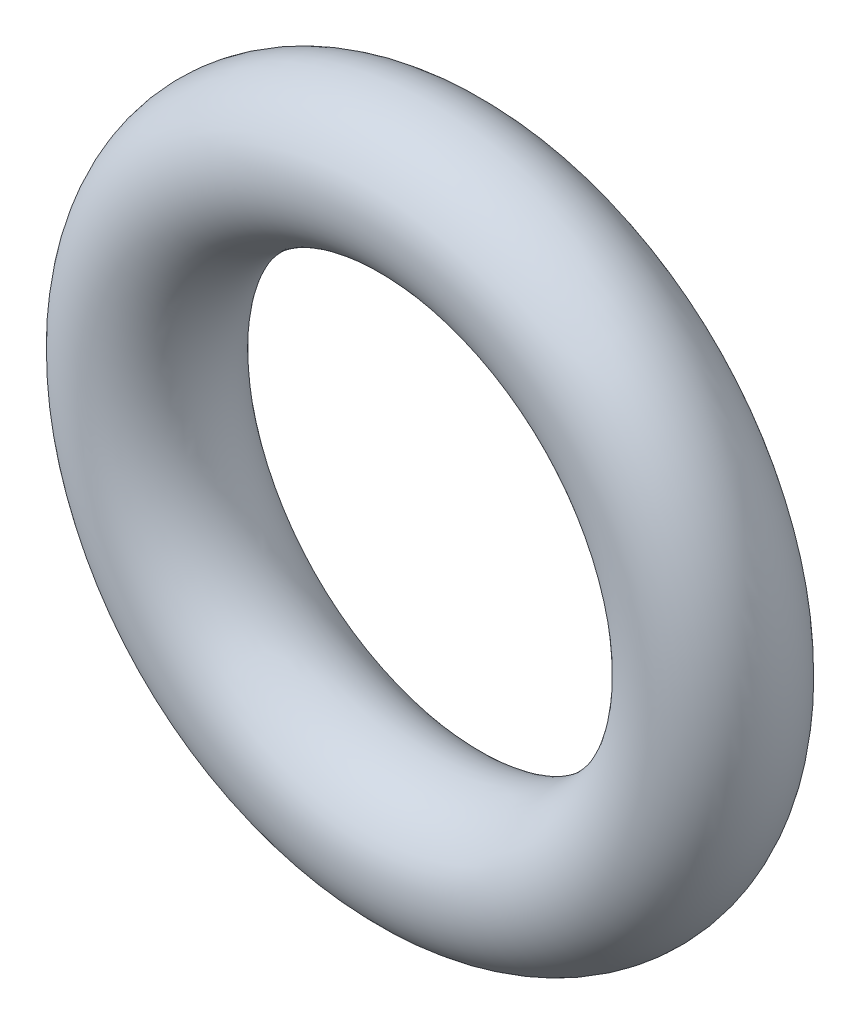
ISO-10303-21;
HEADER;
FILE_DESCRIPTION(('STEP AP214'),'2;1');
FILE_NAME('part.step','',(''),(''),'','','');
FILE_SCHEMA(('AUTOMOTIVE_DESIGN { 1 0 10303 214 1 1 1 1 }'));
ENDSEC;
DATA;
#1=APPLICATION_CONTEXT('core data for automotive mechanical design processes');
#2=APPLICATION_PROTOCOL_DEFINITION('international standard','automotive_design',2000,#1);
#3=PRODUCT_CONTEXT('',#1,'mechanical');
#4=PRODUCT('Part','Part','',(#3));
#5=PRODUCT_RELATED_PRODUCT_CATEGORY('part','',(#4));
#6=PRODUCT_DEFINITION_FORMATION('','',#4);
#7=PRODUCT_DEFINITION_CONTEXT('part definition',#1,'design');
#8=PRODUCT_DEFINITION('design','',#6,#7);
#9=PRODUCT_DEFINITION_SHAPE('','',#8);
#10=(LENGTH_UNIT() NAMED_UNIT(*) SI_UNIT(.MILLI.,.METRE.));
#11=(NAMED_UNIT(*) PLANE_ANGLE_UNIT() SI_UNIT($,.RADIAN.));
#12=(NAMED_UNIT(*) SI_UNIT($,.STERADIAN.) SOLID_ANGLE_UNIT());
#13=UNCERTAINTY_MEASURE_WITH_UNIT(LENGTH_MEASURE(1.E-05),#10,'distance_accuracy_value','');
#14=(GEOMETRIC_REPRESENTATION_CONTEXT(3) GLOBAL_UNCERTAINTY_ASSIGNED_CONTEXT((#13)) GLOBAL_UNIT_ASSIGNED_CONTEXT((#10,
#11,#12)) REPRESENTATION_CONTEXT('',''));
#15=CARTESIAN_POINT('',(0.,0.,0.));
#16=DIRECTION('',(0.,0.,1.));
#17=DIRECTION('',(1.,0.,0.));
#18=AXIS2_PLACEMENT_3D('',#15,#16,#17);
#19=CARTESIAN_POINT('',(0.,0.,0.));
#20=DIRECTION('',(0.,0.,1.));
#21=DIRECTION('',(1.,0.,0.));
#22=AXIS2_PLACEMENT_3D('',#19,#20,#21);
#23=TOROIDAL_SURFACE('',#22,3.5306,0.888999999999999);
#24=CARTESIAN_POINT('',(4.4196,0.,0.));
#25=VERTEX_POINT('',#24);
#26=VERTEX_LOOP('',#25);
#27=FACE_BOUND('',#26,.T.);
#28=ADVANCED_FACE('F33',(#27),#23,.T.);
#29=CLOSED_SHELL('',(#28));
#30=MANIFOLD_SOLID_BREP('B2',#29);
#31=ADVANCED_BREP_SHAPE_REPRESENTATION('',(#18,#30),#14);
#32=SHAPE_DEFINITION_REPRESENTATION(#9,#31);
ENDSEC;
END-ISO-10303-21;
